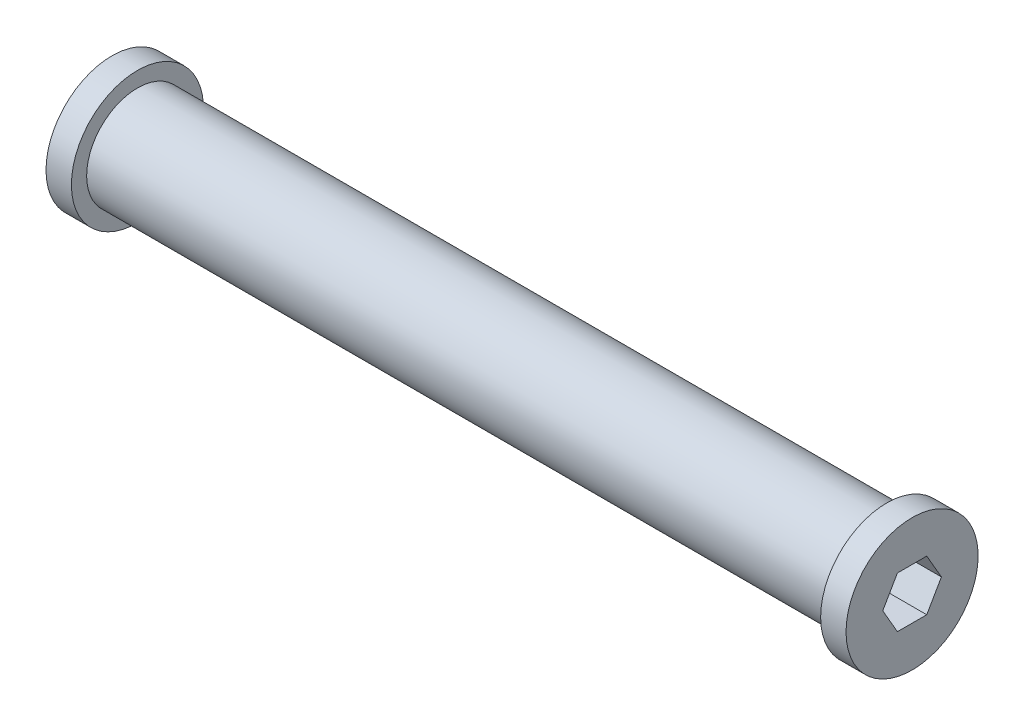
ISO-10303-21;
HEADER;
FILE_DESCRIPTION(('STEP AP214'),'2;1');
FILE_NAME('part.step','',(''),(''),'','','');
FILE_SCHEMA(('AUTOMOTIVE_DESIGN { 1 0 10303 214 1 1 1 1 }'));
ENDSEC;
DATA;
#1=APPLICATION_CONTEXT('core data for automotive mechanical design processes');
#2=APPLICATION_PROTOCOL_DEFINITION('international standard','automotive_design',2000,#1);
#3=PRODUCT_CONTEXT('',#1,'mechanical');
#4=PRODUCT('Part','Part','',(#3));
#5=PRODUCT_RELATED_PRODUCT_CATEGORY('part','',(#4));
#6=PRODUCT_DEFINITION_FORMATION('','',#4);
#7=PRODUCT_DEFINITION_CONTEXT('part definition',#1,'design');
#8=PRODUCT_DEFINITION('design','',#6,#7);
#9=PRODUCT_DEFINITION_SHAPE('','',#8);
#10=(LENGTH_UNIT() NAMED_UNIT(*) SI_UNIT(.MILLI.,.METRE.));
#11=(NAMED_UNIT(*) PLANE_ANGLE_UNIT() SI_UNIT($,.RADIAN.));
#12=(NAMED_UNIT(*) SI_UNIT($,.STERADIAN.) SOLID_ANGLE_UNIT());
#13=UNCERTAINTY_MEASURE_WITH_UNIT(LENGTH_MEASURE(1.E-05),#10,'distance_accuracy_value','');
#14=(GEOMETRIC_REPRESENTATION_CONTEXT(3) GLOBAL_UNCERTAINTY_ASSIGNED_CONTEXT((#13)) GLOBAL_UNIT_ASSIGNED_CONTEXT((#10,
#11,#12)) REPRESENTATION_CONTEXT('',''));
#15=CARTESIAN_POINT('',(0.,0.,0.));
#16=DIRECTION('',(0.,0.,1.));
#17=DIRECTION('',(1.,0.,0.));
#18=AXIS2_PLACEMENT_3D('',#15,#16,#17);
#19=CARTESIAN_POINT('',(100.,6.35000000000004,0.));
#20=DIRECTION('',(-1.,0.,0.));
#21=DIRECTION('',(0.,0.,1.));
#22=AXIS2_PLACEMENT_3D('',#19,#20,#21);
#23=PLANE('',#22);
#24=CARTESIAN_POINT('',(100.,0.,0.));
#25=DIRECTION('',(-1.,0.,0.));
#26=DIRECTION('',(0.,0.,1.));
#27=AXIS2_PLACEMENT_3D('',#24,#25,#26);
#28=CIRCLE('',#27,16.51);
#29=CARTESIAN_POINT('',(100.,0.,16.51));
#30=VERTEX_POINT('',#29);
#31=EDGE_CURVE('E11',#30,#30,#28,.T.);
#32=ORIENTED_EDGE('',*,*,#31,.F.);
#33=EDGE_LOOP('',(#32));
#34=FACE_BOUND('',#33,.T.);
#35=DIRECTION('',(0.,0.,1.));
#36=VECTOR('',#35,1.);
#37=CARTESIAN_POINT('',(100.,6.35000000000003,-3.66617420935414));
#38=LINE('',#37,#36);
#39=CARTESIAN_POINT('',(100.,6.35000000000003,-3.66617420935414));
#40=VERTEX_POINT('',#39);
#41=CARTESIAN_POINT('',(100.,6.35000000000003,3.66617420935414));
#42=VERTEX_POINT('',#41);
#43=EDGE_CURVE('E55',#40,#42,#38,.T.);
#44=ORIENTED_EDGE('',*,*,#43,.F.);
#45=DIRECTION('',(0.,0.866025403784439,0.5));
#46=VECTOR('',#45,1.);
#47=CARTESIAN_POINT('',(100.,0.,-7.33234841870829));
#48=LINE('',#47,#46);
#49=CARTESIAN_POINT('',(100.,0.,-7.33234841870829));
#50=VERTEX_POINT('',#49);
#51=EDGE_CURVE('E105',#50,#40,#48,.T.);
#52=ORIENTED_EDGE('',*,*,#51,.F.);
#53=DIRECTION('',(0.,0.866025403784439,-0.5));
#54=VECTOR('',#53,1.);
#55=CARTESIAN_POINT('',(100.,-6.35000000000004,-3.66617420935414));
#56=LINE('',#55,#54);
#57=CARTESIAN_POINT('',(100.,-6.35000000000004,-3.66617420935414));
#58=VERTEX_POINT('',#57);
#59=EDGE_CURVE('E100',#58,#50,#56,.T.);
#60=ORIENTED_EDGE('',*,*,#59,.F.);
#61=DIRECTION('',(0.,0.,-1.));
#62=VECTOR('',#61,1.);
#63=CARTESIAN_POINT('',(100.,-6.35000000000004,3.66617420935413));
#64=LINE('',#63,#62);
#65=CARTESIAN_POINT('',(100.,-6.35000000000004,3.66617420935413));
#66=VERTEX_POINT('',#65);
#67=EDGE_CURVE('E129',#66,#58,#64,.T.);
#68=ORIENTED_EDGE('',*,*,#67,.F.);
#69=DIRECTION('',(0.,-0.866025403784438,-0.5));
#70=VECTOR('',#69,1.);
#71=CARTESIAN_POINT('',(100.,0.,7.33234841870828));
#72=LINE('',#71,#70);
#73=CARTESIAN_POINT('',(100.,0.,7.33234841870828));
#74=VERTEX_POINT('',#73);
#75=EDGE_CURVE('E126',#74,#66,#72,.T.);
#76=ORIENTED_EDGE('',*,*,#75,.F.);
#77=DIRECTION('',(0.,-0.866025403784439,0.5));
#78=VECTOR('',#77,1.);
#79=CARTESIAN_POINT('',(100.,6.35000000000003,3.66617420935414));
#80=LINE('',#79,#78);
#81=EDGE_CURVE('E123',#42,#74,#80,.T.);
#82=ORIENTED_EDGE('',*,*,#81,.F.);
#83=EDGE_LOOP('',(#44,#52,#60,#68,#76,#82));
#84=FACE_BOUND('',#83,.T.);
#85=ADVANCED_FACE('F41',(#34,#84),#23,.F.);
#86=CARTESIAN_POINT('',(0.,0.,0.));
#87=DIRECTION('',(-1.,0.,0.));
#88=DIRECTION('',(0.,0.,1.));
#89=AXIS2_PLACEMENT_3D('',#86,#87,#88);
#90=CYLINDRICAL_SURFACE('',#89,16.51);
#91=CARTESIAN_POINT('',(93.65,0.,0.));
#92=DIRECTION('',(-1.,0.,0.));
#93=DIRECTION('',(0.,0.,1.));
#94=AXIS2_PLACEMENT_3D('',#91,#92,#93);
#95=CIRCLE('',#94,16.51);
#96=CARTESIAN_POINT('',(93.65,0.,16.51));
#97=VERTEX_POINT('',#96);
#98=EDGE_CURVE('E48',#97,#97,#95,.T.);
#99=ORIENTED_EDGE('',*,*,#98,.F.);
#100=EDGE_LOOP('',(#99));
#101=FACE_BOUND('',#100,.T.);
#102=ORIENTED_EDGE('',*,*,#31,.T.);
#103=EDGE_LOOP('',(#102));
#104=FACE_BOUND('',#103,.T.);
#105=ADVANCED_FACE('F161',(#101,#104),#90,.T.);
#106=CARTESIAN_POINT('',(93.65,16.51,0.));
#107=DIRECTION('',(1.,0.,0.));
#108=DIRECTION('',(0.,0.,-1.));
#109=AXIS2_PLACEMENT_3D('',#106,#107,#108);
#110=PLANE('',#109);
#111=CARTESIAN_POINT('',(93.65,0.,0.));
#112=DIRECTION('',(-1.,0.,0.));
#113=DIRECTION('',(0.,0.,1.));
#114=AXIS2_PLACEMENT_3D('',#111,#112,#113);
#115=CIRCLE('',#114,12.7);
#116=CARTESIAN_POINT('',(93.65,0.,12.7));
#117=VERTEX_POINT('',#116);
#118=EDGE_CURVE('E154',#117,#117,#115,.T.);
#119=ORIENTED_EDGE('',*,*,#118,.F.);
#120=EDGE_LOOP('',(#119));
#121=FACE_BOUND('',#120,.T.);
#122=ORIENTED_EDGE('',*,*,#98,.T.);
#123=EDGE_LOOP('',(#122));
#124=FACE_BOUND('',#123,.T.);
#125=ADVANCED_FACE('F159',(#121,#124),#110,.F.);
#126=CARTESIAN_POINT('',(0.,0.,0.));
#127=DIRECTION('',(-1.,0.,0.));
#128=DIRECTION('',(0.,0.,1.));
#129=AXIS2_PLACEMENT_3D('',#126,#127,#128);
#130=CYLINDRICAL_SURFACE('',#129,12.7);
#131=CARTESIAN_POINT('',(-93.65,0.,0.));
#132=DIRECTION('',(-1.,0.,0.));
#133=DIRECTION('',(0.,0.,1.));
#134=AXIS2_PLACEMENT_3D('',#131,#132,#133);
#135=CIRCLE('',#134,12.7);
#136=CARTESIAN_POINT('',(-93.65,0.,12.7));
#137=VERTEX_POINT('',#136);
#138=EDGE_CURVE('E151',#137,#137,#135,.T.);
#139=ORIENTED_EDGE('',*,*,#138,.F.);
#140=EDGE_LOOP('',(#139));
#141=FACE_BOUND('',#140,.T.);
#142=ORIENTED_EDGE('',*,*,#118,.T.);
#143=EDGE_LOOP('',(#142));
#144=FACE_BOUND('',#143,.T.);
#145=ADVANCED_FACE('F181',(#141,#144),#130,.T.);
#146=CARTESIAN_POINT('',(-93.65,12.7,0.));
#147=DIRECTION('',(-1.,0.,0.));
#148=DIRECTION('',(0.,0.,1.));
#149=AXIS2_PLACEMENT_3D('',#146,#147,#148);
#150=PLANE('',#149);
#151=CARTESIAN_POINT('',(-93.65,0.,0.));
#152=DIRECTION('',(-1.,0.,0.));
#153=DIRECTION('',(0.,0.,1.));
#154=AXIS2_PLACEMENT_3D('',#151,#152,#153);
#155=CIRCLE('',#154,16.51);
#156=CARTESIAN_POINT('',(-93.65,0.,16.51));
#157=VERTEX_POINT('',#156);
#158=EDGE_CURVE('E148',#157,#157,#155,.T.);
#159=ORIENTED_EDGE('',*,*,#158,.F.);
#160=EDGE_LOOP('',(#159));
#161=FACE_BOUND('',#160,.T.);
#162=ORIENTED_EDGE('',*,*,#138,.T.);
#163=EDGE_LOOP('',(#162));
#164=FACE_BOUND('',#163,.T.);
#165=ADVANCED_FACE('F189',(#161,#164),#150,.F.);
#166=CARTESIAN_POINT('',(0.,0.,0.));
#167=DIRECTION('',(-1.,0.,0.));
#168=DIRECTION('',(0.,0.,1.));
#169=AXIS2_PLACEMENT_3D('',#166,#167,#168);
#170=CYLINDRICAL_SURFACE('',#169,16.51);
#171=CARTESIAN_POINT('',(-100.,0.,0.));
#172=DIRECTION('',(-1.,0.,0.));
#173=DIRECTION('',(0.,0.,1.));
#174=AXIS2_PLACEMENT_3D('',#171,#172,#173);
#175=CIRCLE('',#174,16.51);
#176=CARTESIAN_POINT('',(-100.,0.,16.51));
#177=VERTEX_POINT('',#176);
#178=EDGE_CURVE('E135',#177,#177,#175,.T.);
#179=ORIENTED_EDGE('',*,*,#178,.F.);
#180=EDGE_LOOP('',(#179));
#181=FACE_BOUND('',#180,.T.);
#182=ORIENTED_EDGE('',*,*,#158,.T.);
#183=EDGE_LOOP('',(#182));
#184=FACE_BOUND('',#183,.T.);
#185=ADVANCED_FACE('F197',(#181,#184),#170,.T.);
#186=CARTESIAN_POINT('',(-100.,16.51,0.));
#187=DIRECTION('',(1.,0.,0.));
#188=DIRECTION('',(0.,0.,-1.));
#189=AXIS2_PLACEMENT_3D('',#186,#187,#188);
#190=PLANE('',#189);
#191=DIRECTION('',(0.,-0.866025403784438,-0.5));
#192=VECTOR('',#191,1.);
#193=CARTESIAN_POINT('',(-100.,0.,7.33234841870828));
#194=LINE('',#193,#192);
#195=CARTESIAN_POINT('',(-100.,0.,7.33234841870828));
#196=VERTEX_POINT('',#195);
#197=CARTESIAN_POINT('',(-100.,-6.35000000000004,3.66617420935413));
#198=VERTEX_POINT('',#197);
#199=EDGE_CURVE('E114',#196,#198,#194,.T.);
#200=ORIENTED_EDGE('',*,*,#199,.T.);
#201=DIRECTION('',(0.,0.,-1.));
#202=VECTOR('',#201,1.);
#203=CARTESIAN_POINT('',(-100.,-6.35000000000004,3.66617420935413));
#204=LINE('',#203,#202);
#205=CARTESIAN_POINT('',(-100.,-6.35000000000004,-3.66617420935414));
#206=VERTEX_POINT('',#205);
#207=EDGE_CURVE('E118',#198,#206,#204,.T.);
#208=ORIENTED_EDGE('',*,*,#207,.T.);
#209=DIRECTION('',(0.,0.866025403784439,-0.5));
#210=VECTOR('',#209,1.);
#211=CARTESIAN_POINT('',(-100.,-6.35000000000004,-3.66617420935414));
#212=LINE('',#211,#210);
#213=CARTESIAN_POINT('',(-100.,0.,-7.33234841870829));
#214=VERTEX_POINT('',#213);
#215=EDGE_CURVE('E96',#206,#214,#212,.T.);
#216=ORIENTED_EDGE('',*,*,#215,.T.);
#217=DIRECTION('',(0.,0.866025403784439,0.5));
#218=VECTOR('',#217,1.);
#219=CARTESIAN_POINT('',(-100.,0.,-7.33234841870829));
#220=LINE('',#219,#218);
#221=CARTESIAN_POINT('',(-100.,6.35000000000003,-3.66617420935414));
#222=VERTEX_POINT('',#221);
#223=EDGE_CURVE('E91',#214,#222,#220,.T.);
#224=ORIENTED_EDGE('',*,*,#223,.T.);
#225=DIRECTION('',(0.,0.,1.));
#226=VECTOR('',#225,1.);
#227=CARTESIAN_POINT('',(-100.,6.35000000000003,-3.66617420935414));
#228=LINE('',#227,#226);
#229=CARTESIAN_POINT('',(-100.,6.35000000000003,3.66617420935414));
#230=VERTEX_POINT('',#229);
#231=EDGE_CURVE('E63',#222,#230,#228,.T.);
#232=ORIENTED_EDGE('',*,*,#231,.T.);
#233=DIRECTION('',(0.,-0.866025403784439,0.5));
#234=VECTOR('',#233,1.);
#235=CARTESIAN_POINT('',(-100.,6.35000000000003,3.66617420935414));
#236=LINE('',#235,#234);
#237=EDGE_CURVE('E112',#230,#196,#236,.T.);
#238=ORIENTED_EDGE('',*,*,#237,.T.);
#239=EDGE_LOOP('',(#200,#208,#216,#224,#232,#238));
#240=FACE_BOUND('',#239,.T.);
#241=ORIENTED_EDGE('',*,*,#178,.T.);
#242=EDGE_LOOP('',(#241));
#243=FACE_BOUND('',#242,.T.);
#244=ADVANCED_FACE('F93',(#240,#243),#190,.F.);
#245=CARTESIAN_POINT('',(-100.,0.,-7.33234841870829));
#246=DIRECTION('',(0.,0.5,-0.866025403784439));
#247=DIRECTION('',(0.,0.866025403784439,0.5));
#248=AXIS2_PLACEMENT_3D('',#245,#246,#247);
#249=PLANE('',#248);
#250=ORIENTED_EDGE('',*,*,#223,.F.);
#251=DIRECTION('',(1.,0.,0.));
#252=VECTOR('',#251,1.);
#253=CARTESIAN_POINT('',(-100.,0.,-7.33234841870829));
#254=LINE('',#253,#252);
#255=EDGE_CURVE('E133',#214,#50,#254,.T.);
#256=ORIENTED_EDGE('',*,*,#255,.T.);
#257=ORIENTED_EDGE('',*,*,#51,.T.);
#258=DIRECTION('',(1.,0.,0.));
#259=VECTOR('',#258,1.);
#260=CARTESIAN_POINT('',(-100.,6.35000000000003,-3.66617420935414));
#261=LINE('',#260,#259);
#262=EDGE_CURVE('E103',#222,#40,#261,.T.);
#263=ORIENTED_EDGE('',*,*,#262,.F.);
#264=EDGE_LOOP('',(#250,#256,#257,#263));
#265=FACE_BOUND('',#264,.T.);
#266=ADVANCED_FACE('F104',(#265),#249,.F.);
#267=CARTESIAN_POINT('',(-100.,-6.35000000000004,-3.66617420935414));
#268=DIRECTION('',(0.,-0.5,-0.866025403784439));
#269=DIRECTION('',(0.,0.866025403784439,-0.5));
#270=AXIS2_PLACEMENT_3D('',#267,#268,#269);
#271=PLANE('',#270);
#272=ORIENTED_EDGE('',*,*,#215,.F.);
#273=DIRECTION('',(1.,0.,0.));
#274=VECTOR('',#273,1.);
#275=CARTESIAN_POINT('',(-100.,-6.35000000000004,-3.66617420935414));
#276=LINE('',#275,#274);
#277=EDGE_CURVE('E136',#206,#58,#276,.T.);
#278=ORIENTED_EDGE('',*,*,#277,.T.);
#279=ORIENTED_EDGE('',*,*,#59,.T.);
#280=ORIENTED_EDGE('',*,*,#255,.F.);
#281=EDGE_LOOP('',(#272,#278,#279,#280));
#282=FACE_BOUND('',#281,.T.);
#283=ADVANCED_FACE('F216',(#282),#271,.F.);
#284=CARTESIAN_POINT('',(-100.,-6.35000000000004,3.66617420935413));
#285=DIRECTION('',(0.,-1.,0.));
#286=DIRECTION('',(0.,0.,-1.));
#287=AXIS2_PLACEMENT_3D('',#284,#285,#286);
#288=PLANE('',#287);
#289=ORIENTED_EDGE('',*,*,#207,.F.);
#290=DIRECTION('',(1.,0.,0.));
#291=VECTOR('',#290,1.);
#292=CARTESIAN_POINT('',(-100.,-6.35000000000004,3.66617420935413));
#293=LINE('',#292,#291);
#294=EDGE_CURVE('E139',#198,#66,#293,.T.);
#295=ORIENTED_EDGE('',*,*,#294,.T.);
#296=ORIENTED_EDGE('',*,*,#67,.T.);
#297=ORIENTED_EDGE('',*,*,#277,.F.);
#298=EDGE_LOOP('',(#289,#295,#296,#297));
#299=FACE_BOUND('',#298,.T.);
#300=ADVANCED_FACE('F223',(#299),#288,.F.);
#301=CARTESIAN_POINT('',(-100.,0.,7.33234841870828));
#302=DIRECTION('',(0.,-0.5,0.866025403784438));
#303=DIRECTION('',(0.,-0.866025403784439,-0.5));
#304=AXIS2_PLACEMENT_3D('',#301,#302,#303);
#305=PLANE('',#304);
#306=ORIENTED_EDGE('',*,*,#199,.F.);
#307=DIRECTION('',(1.,0.,0.));
#308=VECTOR('',#307,1.);
#309=CARTESIAN_POINT('',(-100.,0.,7.33234841870828));
#310=LINE('',#309,#308);
#311=EDGE_CURVE('E142',#196,#74,#310,.T.);
#312=ORIENTED_EDGE('',*,*,#311,.T.);
#313=ORIENTED_EDGE('',*,*,#75,.T.);
#314=ORIENTED_EDGE('',*,*,#294,.F.);
#315=EDGE_LOOP('',(#306,#312,#313,#314));
#316=FACE_BOUND('',#315,.T.);
#317=ADVANCED_FACE('F231',(#316),#305,.F.);
#318=CARTESIAN_POINT('',(-100.,6.35000000000003,3.66617420935414));
#319=DIRECTION('',(0.,0.5,0.866025403784439));
#320=DIRECTION('',(0.,-0.866025403784439,0.5));
#321=AXIS2_PLACEMENT_3D('',#318,#319,#320);
#322=PLANE('',#321);
#323=ORIENTED_EDGE('',*,*,#237,.F.);
#324=DIRECTION('',(1.,0.,0.));
#325=VECTOR('',#324,1.);
#326=CARTESIAN_POINT('',(-100.,6.35000000000003,3.66617420935414));
#327=LINE('',#326,#325);
#328=EDGE_CURVE('E107',#230,#42,#327,.T.);
#329=ORIENTED_EDGE('',*,*,#328,.T.);
#330=ORIENTED_EDGE('',*,*,#81,.T.);
#331=ORIENTED_EDGE('',*,*,#311,.F.);
#332=EDGE_LOOP('',(#323,#329,#330,#331));
#333=FACE_BOUND('',#332,.T.);
#334=ADVANCED_FACE('F239',(#333),#322,.F.);
#335=CARTESIAN_POINT('',(-100.,6.35000000000003,-3.66617420935414));
#336=DIRECTION('',(0.,1.,0.));
#337=DIRECTION('',(0.,0.,1.));
#338=AXIS2_PLACEMENT_3D('',#335,#336,#337);
#339=PLANE('',#338);
#340=ORIENTED_EDGE('',*,*,#231,.F.);
#341=ORIENTED_EDGE('',*,*,#262,.T.);
#342=ORIENTED_EDGE('',*,*,#43,.T.);
#343=ORIENTED_EDGE('',*,*,#328,.F.);
#344=EDGE_LOOP('',(#340,#341,#342,#343));
#345=FACE_BOUND('',#344,.T.);
#346=ADVANCED_FACE('F110',(#345),#339,.F.);
#347=CLOSED_SHELL('',(#85,#105,#125,#145,#165,#185,#244,#266,#283,#300,#317,#334,#346));
#348=MANIFOLD_SOLID_BREP('B2',#347);
#349=ADVANCED_BREP_SHAPE_REPRESENTATION('',(#18,#348),#14);
#350=SHAPE_DEFINITION_REPRESENTATION(#9,#349);
ENDSEC;
END-ISO-10303-21;
